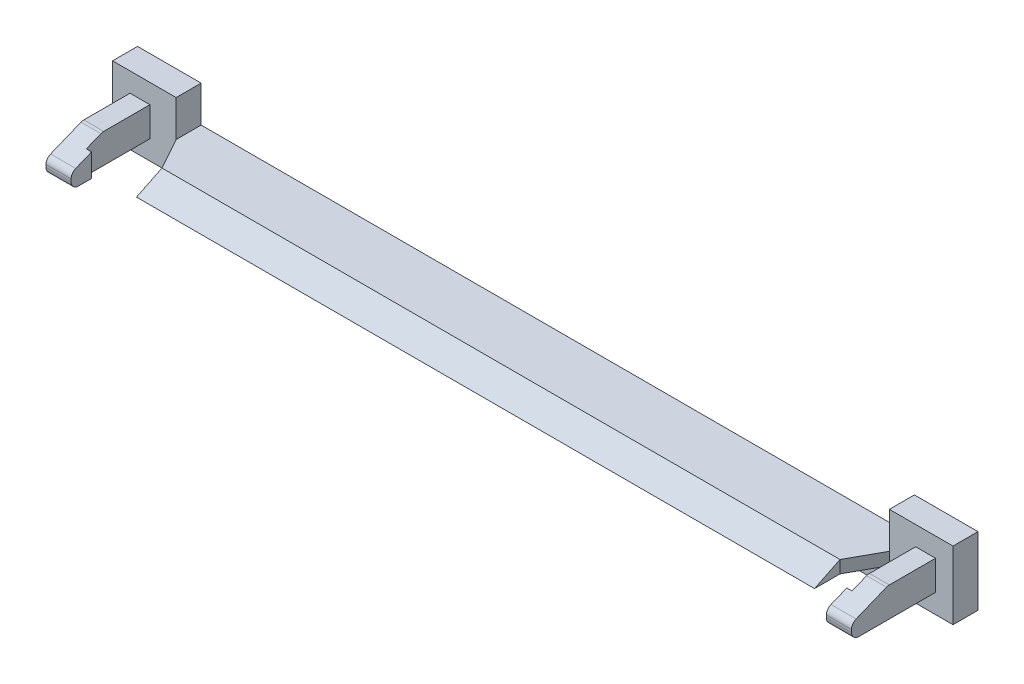
ISO-10303-21;
HEADER;
FILE_DESCRIPTION(('STEP AP214'),'2;1');
FILE_NAME('part.step','',(''),(''),'','','');
FILE_SCHEMA(('AUTOMOTIVE_DESIGN { 1 0 10303 214 1 1 1 1 }'));
ENDSEC;
DATA;
#1=APPLICATION_CONTEXT('core data for automotive mechanical design processes');
#2=APPLICATION_PROTOCOL_DEFINITION('international standard','automotive_design',2000,#1);
#3=PRODUCT_CONTEXT('',#1,'mechanical');
#4=PRODUCT('Part','Part','',(#3));
#5=PRODUCT_RELATED_PRODUCT_CATEGORY('part','',(#4));
#6=PRODUCT_DEFINITION_FORMATION('','',#4);
#7=PRODUCT_DEFINITION_CONTEXT('part definition',#1,'design');
#8=PRODUCT_DEFINITION('design','',#6,#7);
#9=PRODUCT_DEFINITION_SHAPE('','',#8);
#10=(LENGTH_UNIT() NAMED_UNIT(*) SI_UNIT(.MILLI.,.METRE.));
#11=(NAMED_UNIT(*) PLANE_ANGLE_UNIT() SI_UNIT($,.RADIAN.));
#12=(NAMED_UNIT(*) SI_UNIT($,.STERADIAN.) SOLID_ANGLE_UNIT());
#13=UNCERTAINTY_MEASURE_WITH_UNIT(LENGTH_MEASURE(1.E-05),#10,'distance_accuracy_value','');
#14=(GEOMETRIC_REPRESENTATION_CONTEXT(3) GLOBAL_UNCERTAINTY_ASSIGNED_CONTEXT((#13)) GLOBAL_UNIT_ASSIGNED_CONTEXT((#10,
#11,#12)) REPRESENTATION_CONTEXT('',''));
#15=CARTESIAN_POINT('',(0.,0.,0.));
#16=DIRECTION('',(0.,0.,1.));
#17=DIRECTION('',(1.,0.,0.));
#18=AXIS2_PLACEMENT_3D('',#15,#16,#17);
#19=CARTESIAN_POINT('',(16.625,-0.218763919545653,4.475));
#20=DIRECTION('',(1.,0.,0.));
#21=DIRECTION('',(0.,0.,-1.));
#22=AXIS2_PLACEMENT_3D('',#19,#20,#21);
#23=PLANE('',#22);
#24=CARTESIAN_POINT('',(16.625,-0.325000000000007,4.475));
#25=DIRECTION('',(-1.,0.,0.));
#26=DIRECTION('',(0.,-1.,0.));
#27=AXIS2_PLACEMENT_3D('',#24,#25,#26);
#28=CIRCLE('',#27,0.325);
#29=CARTESIAN_POINT('',(16.625,-0.325000000000007,4.8));
#30=VERTEX_POINT('',#29);
#31=CARTESIAN_POINT('',(16.625,-0.65,4.475));
#32=VERTEX_POINT('',#31);
#33=EDGE_CURVE('E247',#30,#32,#28,.F.);
#34=ORIENTED_EDGE('',*,*,#33,.F.);
#35=DIRECTION('',(0.,1.,0.));
#36=VECTOR('',#35,1.);
#37=CARTESIAN_POINT('',(16.625,-0.65,4.8));
#38=LINE('',#37,#36);
#39=CARTESIAN_POINT('',(16.625,-0.218763919545653,4.8));
#40=VERTEX_POINT('',#39);
#41=EDGE_CURVE('E237',#30,#40,#38,.T.);
#42=ORIENTED_EDGE('',*,*,#41,.T.);
#43=CARTESIAN_POINT('',(16.625,-0.218763919545653,4.475));
#44=DIRECTION('',(1.,0.,0.));
#45=DIRECTION('',(0.,0.,-1.));
#46=AXIS2_PLACEMENT_3D('',#43,#44,#45);
#47=CIRCLE('',#46,0.325);
#48=CARTESIAN_POINT('',(16.625,0.0823377180190975,4.59732254026068));
#49=VERTEX_POINT('',#48);
#50=EDGE_CURVE('E19',#49,#40,#47,.T.);
#51=ORIENTED_EDGE('',*,*,#50,.F.);
#52=DIRECTION('',(0.,-0.376377046955938,0.926466577122309));
#53=VECTOR('',#52,1.);
#54=CARTESIAN_POINT('',(16.625,0.,4.8));
#55=LINE('',#54,#53);
#56=CARTESIAN_POINT('',(16.625,0.365624999999999,3.9));
#57=VERTEX_POINT('',#56);
#58=EDGE_CURVE('E223',#57,#49,#55,.T.);
#59=ORIENTED_EDGE('',*,*,#58,.F.);
#60=DIRECTION('',(0.,1.,0.));
#61=VECTOR('',#60,1.);
#62=CARTESIAN_POINT('',(16.625,-0.65,3.9));
#63=LINE('',#62,#61);
#64=CARTESIAN_POINT('',(16.625,-0.65,3.9));
#65=VERTEX_POINT('',#64);
#66=EDGE_CURVE('E315',#65,#57,#63,.T.);
#67=ORIENTED_EDGE('',*,*,#66,.F.);
#68=DIRECTION('',(0.,0.,1.));
#69=VECTOR('',#68,1.);
#70=CARTESIAN_POINT('',(16.625,-0.65,4.8));
#71=LINE('',#70,#69);
#72=EDGE_CURVE('E300',#32,#65,#71,.F.);
#73=ORIENTED_EDGE('',*,*,#72,.F.);
#74=EDGE_LOOP('',(#34,#42,#51,#59,#67,#73));
#75=FACE_BOUND('',#74,.T.);
#76=ADVANCED_FACE('F16',(#75),#23,.F.);
#77=CARTESIAN_POINT('',(16.625,-0.65,3.9));
#78=DIRECTION('',(0.,0.,-1.));
#79=DIRECTION('',(-1.,0.,0.));
#80=AXIS2_PLACEMENT_3D('',#77,#78,#79);
#81=PLANE('',#80);
#82=ORIENTED_EDGE('',*,*,#66,.T.);
#83=DIRECTION('',(1.,0.,0.));
#84=VECTOR('',#83,1.);
#85=CARTESIAN_POINT('',(37.4304772879417,0.365624999999999,3.9));
#86=LINE('',#85,#84);
#87=CARTESIAN_POINT('',(16.855,0.365625,3.9));
#88=VERTEX_POINT('',#87);
#89=EDGE_CURVE('E254',#88,#57,#86,.F.);
#90=ORIENTED_EDGE('',*,*,#89,.F.);
#91=DIRECTION('',(0.,1.,0.));
#92=VECTOR('',#91,1.);
#93=CARTESIAN_POINT('',(16.855,-0.65,3.9));
#94=LINE('',#93,#92);
#95=CARTESIAN_POINT('',(16.855,-0.65,3.9));
#96=VERTEX_POINT('',#95);
#97=EDGE_CURVE('E318',#96,#88,#94,.T.);
#98=ORIENTED_EDGE('',*,*,#97,.F.);
#99=DIRECTION('',(1.,0.,0.));
#100=VECTOR('',#99,1.);
#101=CARTESIAN_POINT('',(17.73,-0.65,3.9));
#102=LINE('',#101,#100);
#103=EDGE_CURVE('E324',#65,#96,#102,.T.);
#104=ORIENTED_EDGE('',*,*,#103,.F.);
#105=EDGE_LOOP('',(#82,#90,#98,#104));
#106=FACE_BOUND('',#105,.T.);
#107=ADVANCED_FACE('F339',(#106),#81,.T.);
#108=CARTESIAN_POINT('',(37.4304772879417,0.,4.8));
#109=DIRECTION('',(0.,0.926466577122309,0.376377046955938));
#110=DIRECTION('',(0.,-0.376377046955938,0.926466577122309));
#111=AXIS2_PLACEMENT_3D('',#108,#109,#110);
#112=PLANE('',#111);
#113=DIRECTION('',(0.,-0.37637704695594,0.926466577122309));
#114=VECTOR('',#113,1.);
#115=CARTESIAN_POINT('',(17.73,0.626101637564757,3.25882673830214));
#116=LINE('',#115,#114);
#117=CARTESIAN_POINT('',(17.73,0.626101637564757,3.25882673830214));
#118=VERTEX_POINT('',#117);
#119=CARTESIAN_POINT('',(17.73,0.0823377180190975,4.59732254026068));
#120=VERTEX_POINT('',#119);
#121=EDGE_CURVE('E287',#118,#120,#116,.T.);
#122=ORIENTED_EDGE('',*,*,#121,.F.);
#123=DIRECTION('',(1.,0.,0.));
#124=VECTOR('',#123,1.);
#125=CARTESIAN_POINT('',(37.4304772879417,0.626101637564758,3.25882673830213));
#126=LINE('',#125,#124);
#127=CARTESIAN_POINT('',(16.855,0.626101637564757,3.25882673830214));
#128=VERTEX_POINT('',#127);
#129=EDGE_CURVE('E291',#128,#118,#126,.T.);
#130=ORIENTED_EDGE('',*,*,#129,.F.);
#131=DIRECTION('',(0.,0.37637704695594,-0.926466577122308));
#132=VECTOR('',#131,1.);
#133=CARTESIAN_POINT('',(16.855,0.365625,3.9));
#134=LINE('',#133,#132);
#135=EDGE_CURVE('E320',#88,#128,#134,.T.);
#136=ORIENTED_EDGE('',*,*,#135,.F.);
#137=ORIENTED_EDGE('',*,*,#89,.T.);
#138=ORIENTED_EDGE('',*,*,#58,.T.);
#139=DIRECTION('',(1.,0.,0.));
#140=VECTOR('',#139,1.);
#141=CARTESIAN_POINT('',(37.4304772879417,0.0823377180190974,4.59732254026068));
#142=LINE('',#141,#140);
#143=EDGE_CURVE('E234',#120,#49,#142,.F.);
#144=ORIENTED_EDGE('',*,*,#143,.F.);
#145=EDGE_LOOP('',(#122,#130,#136,#137,#138,#144));
#146=FACE_BOUND('',#145,.T.);
#147=ADVANCED_FACE('F447',(#146),#112,.T.);
#148=CARTESIAN_POINT('',(37.4304772879417,-0.218763919545653,4.475));
#149=DIRECTION('',(1.,0.,0.));
#150=DIRECTION('',(0.,0.,-1.));
#151=AXIS2_PLACEMENT_3D('',#148,#149,#150);
#152=CYLINDRICAL_SURFACE('',#151,0.325);
#153=DIRECTION('',(-1.,0.,0.));
#154=VECTOR('',#153,1.);
#155=CARTESIAN_POINT('',(17.73,-0.218763919545653,4.8));
#156=LINE('',#155,#154);
#157=CARTESIAN_POINT('',(17.73,-0.218763919545653,4.8));
#158=VERTEX_POINT('',#157);
#159=EDGE_CURVE('E232',#40,#158,#156,.F.);
#160=ORIENTED_EDGE('',*,*,#159,.T.);
#161=CARTESIAN_POINT('',(17.73,-0.218763919545653,4.475));
#162=DIRECTION('',(1.,0.,0.));
#163=DIRECTION('',(0.,0.,-1.));
#164=AXIS2_PLACEMENT_3D('',#161,#162,#163);
#165=CIRCLE('',#164,0.325);
#166=EDGE_CURVE('E285',#120,#158,#165,.T.);
#167=ORIENTED_EDGE('',*,*,#166,.F.);
#168=ORIENTED_EDGE('',*,*,#143,.T.);
#169=ORIENTED_EDGE('',*,*,#50,.T.);
#170=EDGE_LOOP('',(#160,#167,#168,#169));
#171=FACE_BOUND('',#170,.T.);
#172=ADVANCED_FACE('F230',(#171),#152,.T.);
#173=CARTESIAN_POINT('',(17.73,-0.65,4.8));
#174=DIRECTION('',(0.,0.,-1.));
#175=DIRECTION('',(-1.,0.,0.));
#176=AXIS2_PLACEMENT_3D('',#173,#174,#175);
#177=PLANE('',#176);
#178=ORIENTED_EDGE('',*,*,#159,.F.);
#179=ORIENTED_EDGE('',*,*,#41,.F.);
#180=DIRECTION('',(-1.,0.,0.));
#181=VECTOR('',#180,1.);
#182=CARTESIAN_POINT('',(17.73,-0.325000000000007,4.8));
#183=LINE('',#182,#181);
#184=CARTESIAN_POINT('',(17.73,-0.325000000000007,4.8));
#185=VERTEX_POINT('',#184);
#186=EDGE_CURVE('E243',#185,#30,#183,.T.);
#187=ORIENTED_EDGE('',*,*,#186,.F.);
#188=DIRECTION('',(0.,1.,0.));
#189=VECTOR('',#188,1.);
#190=CARTESIAN_POINT('',(17.73,0.65,4.8));
#191=LINE('',#190,#189);
#192=EDGE_CURVE('E242',#158,#185,#191,.F.);
#193=ORIENTED_EDGE('',*,*,#192,.F.);
#194=EDGE_LOOP('',(#178,#179,#187,#193));
#195=FACE_BOUND('',#194,.T.);
#196=ADVANCED_FACE('F239',(#195),#177,.F.);
#197=CARTESIAN_POINT('',(17.73,-0.325000000000007,4.475));
#198=DIRECTION('',(-1.,0.,0.));
#199=DIRECTION('',(0.,-1.,0.));
#200=AXIS2_PLACEMENT_3D('',#197,#198,#199);
#201=CYLINDRICAL_SURFACE('',#200,0.325);
#202=ORIENTED_EDGE('',*,*,#33,.T.);
#203=DIRECTION('',(1.,0.,0.));
#204=VECTOR('',#203,1.);
#205=CARTESIAN_POINT('',(17.73,-0.65,4.475));
#206=LINE('',#205,#204);
#207=CARTESIAN_POINT('',(17.73,-0.65,4.475));
#208=VERTEX_POINT('',#207);
#209=EDGE_CURVE('E296',#208,#32,#206,.F.);
#210=ORIENTED_EDGE('',*,*,#209,.F.);
#211=CARTESIAN_POINT('',(17.73,-0.325000000000007,4.475));
#212=DIRECTION('',(-1.,0.,0.));
#213=DIRECTION('',(0.,-1.,0.));
#214=AXIS2_PLACEMENT_3D('',#211,#212,#213);
#215=CIRCLE('',#214,0.325);
#216=EDGE_CURVE('E282',#185,#208,#215,.F.);
#217=ORIENTED_EDGE('',*,*,#216,.F.);
#218=ORIENTED_EDGE('',*,*,#186,.T.);
#219=EDGE_LOOP('',(#202,#210,#217,#218));
#220=FACE_BOUND('',#219,.T.);
#221=ADVANCED_FACE('F448',(#220),#201,.T.);
#222=CARTESIAN_POINT('',(17.73,-0.65,4.8));
#223=DIRECTION('',(0.,-1.,0.));
#224=DIRECTION('',(1.,0.,0.));
#225=AXIS2_PLACEMENT_3D('',#222,#223,#224);
#226=PLANE('',#225);
#227=DIRECTION('',(0.,0.,1.));
#228=VECTOR('',#227,1.);
#229=CARTESIAN_POINT('',(16.855,-0.65,4.8));
#230=LINE('',#229,#228);
#231=CARTESIAN_POINT('',(16.855,-0.65,1.1));
#232=VERTEX_POINT('',#231);
#233=EDGE_CURVE('E292',#232,#96,#230,.T.);
#234=ORIENTED_EDGE('',*,*,#233,.F.);
#235=DIRECTION('',(1.,0.,0.));
#236=VECTOR('',#235,1.);
#237=CARTESIAN_POINT('',(17.73,-0.65,1.1));
#238=LINE('',#237,#236);
#239=CARTESIAN_POINT('',(17.73,-0.65,1.1));
#240=VERTEX_POINT('',#239);
#241=EDGE_CURVE('E295',#232,#240,#238,.T.);
#242=ORIENTED_EDGE('',*,*,#241,.T.);
#243=DIRECTION('',(0.,0.,-1.));
#244=VECTOR('',#243,1.);
#245=CARTESIAN_POINT('',(17.73,-0.65,4.8));
#246=LINE('',#245,#244);
#247=EDGE_CURVE('E284',#208,#240,#246,.T.);
#248=ORIENTED_EDGE('',*,*,#247,.F.);
#249=ORIENTED_EDGE('',*,*,#209,.T.);
#250=ORIENTED_EDGE('',*,*,#72,.T.);
#251=ORIENTED_EDGE('',*,*,#103,.T.);
#252=EDGE_LOOP('',(#234,#242,#248,#249,#250,#251));
#253=FACE_BOUND('',#252,.T.);
#254=ADVANCED_FACE('F333',(#253),#226,.T.);
#255=CARTESIAN_POINT('',(-16.855,-0.65,4.8));
#256=DIRECTION('',(-1.,0.,0.));
#257=DIRECTION('',(0.,0.,1.));
#258=AXIS2_PLACEMENT_3D('',#255,#256,#257);
#259=PLANE('',#258);
#260=DIRECTION('',(0.,1.,0.));
#261=VECTOR('',#260,1.);
#262=CARTESIAN_POINT('',(-16.855,0.365625,3.9));
#263=LINE('',#262,#261);
#264=CARTESIAN_POINT('',(-16.855,-0.65,3.9));
#265=VERTEX_POINT('',#264);
#266=CARTESIAN_POINT('',(-16.855,0.365624999999999,3.9));
#267=VERTEX_POINT('',#266);
#268=EDGE_CURVE('E392',#265,#267,#263,.T.);
#269=ORIENTED_EDGE('',*,*,#268,.F.);
#270=DIRECTION('',(0.,0.,1.));
#271=VECTOR('',#270,1.);
#272=CARTESIAN_POINT('',(-16.855,-0.65,4.8));
#273=LINE('',#272,#271);
#274=CARTESIAN_POINT('',(-16.855,-0.65,1.1));
#275=VERTEX_POINT('',#274);
#276=EDGE_CURVE('E429',#265,#275,#273,.F.);
#277=ORIENTED_EDGE('',*,*,#276,.T.);
#278=DIRECTION('',(0.,1.,0.));
#279=VECTOR('',#278,1.);
#280=CARTESIAN_POINT('',(-16.855,-0.65,1.1));
#281=LINE('',#280,#279);
#282=CARTESIAN_POINT('',(-16.855,0.65,1.1));
#283=VERTEX_POINT('',#282);
#284=EDGE_CURVE('E294',#283,#275,#281,.F.);
#285=ORIENTED_EDGE('',*,*,#284,.F.);
#286=DIRECTION('',(0.,0.,1.));
#287=VECTOR('',#286,1.);
#288=CARTESIAN_POINT('',(-16.855,0.65,4.8));
#289=LINE('',#288,#287);
#290=CARTESIAN_POINT('',(-16.855,0.649999999999998,3.13650419804148));
#291=VERTEX_POINT('',#290);
#292=EDGE_CURVE('E405',#283,#291,#289,.T.);
#293=ORIENTED_EDGE('',*,*,#292,.T.);
#294=CARTESIAN_POINT('',(-16.855,0.324999999999996,3.13650419804148));
#295=DIRECTION('',(-1.,0.,0.));
#296=DIRECTION('',(0.,0.,1.));
#297=AXIS2_PLACEMENT_3D('',#294,#295,#296);
#298=CIRCLE('',#297,0.325);
#299=CARTESIAN_POINT('',(-16.855,0.626101637564747,3.25882673830216));
#300=VERTEX_POINT('',#299);
#301=EDGE_CURVE('E293',#300,#291,#298,.T.);
#302=ORIENTED_EDGE('',*,*,#301,.F.);
#303=DIRECTION('',(0.,0.376377046955938,-0.926466577122309));
#304=VECTOR('',#303,1.);
#305=CARTESIAN_POINT('',(-16.855,0.365625,3.9));
#306=LINE('',#305,#304);
#307=EDGE_CURVE('E402',#267,#300,#306,.T.);
#308=ORIENTED_EDGE('',*,*,#307,.F.);
#309=EDGE_LOOP('',(#269,#277,#285,#293,#302,#308));
#310=FACE_BOUND('',#309,.T.);
#311=ADVANCED_FACE('F456',(#310),#259,.F.);
#312=CARTESIAN_POINT('',(-16.625,0.365625,3.9));
#313=DIRECTION('',(0.,0.,-1.));
#314=DIRECTION('',(-1.,0.,0.));
#315=AXIS2_PLACEMENT_3D('',#312,#313,#314);
#316=PLANE('',#315);
#317=DIRECTION('',(0.,1.,0.));
#318=VECTOR('',#317,1.);
#319=CARTESIAN_POINT('',(-16.625,-0.325,3.9));
#320=LINE('',#319,#318);
#321=CARTESIAN_POINT('',(-16.625,0.365624999999999,3.9));
#322=VERTEX_POINT('',#321);
#323=CARTESIAN_POINT('',(-16.625,-0.65,3.9));
#324=VERTEX_POINT('',#323);
#325=EDGE_CURVE('E321',#322,#324,#320,.F.);
#326=ORIENTED_EDGE('',*,*,#325,.T.);
#327=DIRECTION('',(1.,0.,0.));
#328=VECTOR('',#327,1.);
#329=CARTESIAN_POINT('',(-17.73,-0.65,3.9));
#330=LINE('',#329,#328);
#331=EDGE_CURVE('E423',#324,#265,#330,.F.);
#332=ORIENTED_EDGE('',*,*,#331,.T.);
#333=ORIENTED_EDGE('',*,*,#268,.T.);
#334=DIRECTION('',(1.,0.,0.));
#335=VECTOR('',#334,1.);
#336=CARTESIAN_POINT('',(-37.4304772879417,0.365624999999999,3.9));
#337=LINE('',#336,#335);
#338=EDGE_CURVE('E388',#267,#322,#337,.T.);
#339=ORIENTED_EDGE('',*,*,#338,.T.);
#340=EDGE_LOOP('',(#326,#332,#333,#339));
#341=FACE_BOUND('',#340,.T.);
#342=ADVANCED_FACE('F569',(#341),#316,.T.);
#343=CARTESIAN_POINT('',(-16.625,-0.325,4.475));
#344=DIRECTION('',(-1.,0.,0.));
#345=DIRECTION('',(0.,0.,1.));
#346=AXIS2_PLACEMENT_3D('',#343,#344,#345);
#347=PLANE('',#346);
#348=DIRECTION('',(0.,0.376377046955938,-0.926466577122309));
#349=VECTOR('',#348,1.);
#350=CARTESIAN_POINT('',(-16.625,0.,4.8));
#351=LINE('',#350,#349);
#352=CARTESIAN_POINT('',(-16.625,0.0823377180190975,4.59732254026068));
#353=VERTEX_POINT('',#352);
#354=EDGE_CURVE('E274',#322,#353,#351,.F.);
#355=ORIENTED_EDGE('',*,*,#354,.T.);
#356=CARTESIAN_POINT('',(-16.625,-0.218763919545653,4.475));
#357=DIRECTION('',(1.,0.,0.));
#358=DIRECTION('',(0.,0.,-1.));
#359=AXIS2_PLACEMENT_3D('',#356,#357,#358);
#360=CIRCLE('',#359,0.325);
#361=CARTESIAN_POINT('',(-16.625,-0.218763919545653,4.8));
#362=VERTEX_POINT('',#361);
#363=EDGE_CURVE('E271',#362,#353,#360,.F.);
#364=ORIENTED_EDGE('',*,*,#363,.F.);
#365=DIRECTION('',(0.,1.,0.));
#366=VECTOR('',#365,1.);
#367=CARTESIAN_POINT('',(-16.625,-0.65,4.8));
#368=LINE('',#367,#366);
#369=CARTESIAN_POINT('',(-16.625,-0.325000000000004,4.8));
#370=VERTEX_POINT('',#369);
#371=EDGE_CURVE('E383',#370,#362,#368,.T.);
#372=ORIENTED_EDGE('',*,*,#371,.F.);
#373=CARTESIAN_POINT('',(-16.625,-0.325000000000004,4.475));
#374=DIRECTION('',(1.,0.,0.));
#375=DIRECTION('',(0.,0.,-1.));
#376=AXIS2_PLACEMENT_3D('',#373,#374,#375);
#377=CIRCLE('',#376,0.325);
#378=CARTESIAN_POINT('',(-16.625,-0.65,4.475));
#379=VERTEX_POINT('',#378);
#380=EDGE_CURVE('E275',#379,#370,#377,.F.);
#381=ORIENTED_EDGE('',*,*,#380,.F.);
#382=DIRECTION('',(0.,0.,1.));
#383=VECTOR('',#382,1.);
#384=CARTESIAN_POINT('',(-16.625,-0.65,4.8));
#385=LINE('',#384,#383);
#386=EDGE_CURVE('E420',#379,#324,#385,.F.);
#387=ORIENTED_EDGE('',*,*,#386,.T.);
#388=ORIENTED_EDGE('',*,*,#325,.F.);
#389=EDGE_LOOP('',(#355,#364,#372,#381,#387,#388));
#390=FACE_BOUND('',#389,.T.);
#391=ADVANCED_FACE('F566',(#390),#347,.F.);
#392=CARTESIAN_POINT('',(16.855,-0.65,4.8));
#393=DIRECTION('',(-1.,0.,0.));
#394=DIRECTION('',(0.,0.,1.));
#395=AXIS2_PLACEMENT_3D('',#392,#393,#394);
#396=PLANE('',#395);
#397=DIRECTION('',(0.,1.,0.));
#398=VECTOR('',#397,1.);
#399=CARTESIAN_POINT('',(16.855,-0.65,1.1));
#400=LINE('',#399,#398);
#401=CARTESIAN_POINT('',(16.855,0.65,1.1));
#402=VERTEX_POINT('',#401);
#403=EDGE_CURVE('E311',#402,#232,#400,.F.);
#404=ORIENTED_EDGE('',*,*,#403,.T.);
#405=ORIENTED_EDGE('',*,*,#233,.T.);
#406=ORIENTED_EDGE('',*,*,#97,.T.);
#407=ORIENTED_EDGE('',*,*,#135,.T.);
#408=CARTESIAN_POINT('',(16.855,0.325000000000006,3.13650419804146));
#409=DIRECTION('',(1.,0.,0.));
#410=DIRECTION('',(0.,0.,-1.));
#411=AXIS2_PLACEMENT_3D('',#408,#409,#410);
#412=CIRCLE('',#411,0.325);
#413=CARTESIAN_POINT('',(16.855,0.65,3.13650419804146));
#414=VERTEX_POINT('',#413);
#415=EDGE_CURVE('E288',#414,#128,#412,.T.);
#416=ORIENTED_EDGE('',*,*,#415,.F.);
#417=DIRECTION('',(0.,0.,1.));
#418=VECTOR('',#417,1.);
#419=CARTESIAN_POINT('',(16.855,0.65,4.8));
#420=LINE('',#419,#418);
#421=EDGE_CURVE('E371',#402,#414,#420,.T.);
#422=ORIENTED_EDGE('',*,*,#421,.F.);
#423=EDGE_LOOP('',(#404,#405,#406,#407,#416,#422));
#424=FACE_BOUND('',#423,.T.);
#425=ADVANCED_FACE('F342',(#424),#396,.T.);
#426=CARTESIAN_POINT('',(37.4304772879417,0.325000000000009,3.13650419804145));
#427=DIRECTION('',(1.,0.,0.));
#428=DIRECTION('',(0.,0.,-1.));
#429=AXIS2_PLACEMENT_3D('',#426,#427,#428);
#430=CYLINDRICAL_SURFACE('',#429,0.325);
#431=ORIENTED_EDGE('',*,*,#415,.T.);
#432=ORIENTED_EDGE('',*,*,#129,.T.);
#433=CARTESIAN_POINT('',(17.73,0.325000000000007,3.13650419804146));
#434=DIRECTION('',(1.,0.,0.));
#435=DIRECTION('',(0.,0.,-1.));
#436=AXIS2_PLACEMENT_3D('',#433,#434,#435);
#437=CIRCLE('',#436,0.325);
#438=CARTESIAN_POINT('',(17.73,0.65,3.13650419804146));
#439=VERTEX_POINT('',#438);
#440=EDGE_CURVE('E278',#439,#118,#437,.T.);
#441=ORIENTED_EDGE('',*,*,#440,.F.);
#442=DIRECTION('',(-1.,0.,0.));
#443=VECTOR('',#442,1.);
#444=CARTESIAN_POINT('',(16.855,0.65,3.13650419804146));
#445=LINE('',#444,#443);
#446=EDGE_CURVE('E373',#414,#439,#445,.F.);
#447=ORIENTED_EDGE('',*,*,#446,.F.);
#448=EDGE_LOOP('',(#431,#432,#441,#447));
#449=FACE_BOUND('',#448,.T.);
#450=ADVANCED_FACE('F561',(#449),#430,.T.);
#451=CARTESIAN_POINT('',(17.73,0.65,4.8));
#452=DIRECTION('',(1.,0.,0.));
#453=DIRECTION('',(0.,0.,-1.));
#454=AXIS2_PLACEMENT_3D('',#451,#452,#453);
#455=PLANE('',#454);
#456=DIRECTION('',(0.,0.,1.));
#457=VECTOR('',#456,1.);
#458=CARTESIAN_POINT('',(17.73,0.65,4.8));
#459=LINE('',#458,#457);
#460=CARTESIAN_POINT('',(17.73,0.65,1.1));
#461=VERTEX_POINT('',#460);
#462=EDGE_CURVE('E270',#439,#461,#459,.F.);
#463=ORIENTED_EDGE('',*,*,#462,.F.);
#464=ORIENTED_EDGE('',*,*,#440,.T.);
#465=ORIENTED_EDGE('',*,*,#121,.T.);
#466=ORIENTED_EDGE('',*,*,#166,.T.);
#467=ORIENTED_EDGE('',*,*,#192,.T.);
#468=ORIENTED_EDGE('',*,*,#216,.T.);
#469=ORIENTED_EDGE('',*,*,#247,.T.);
#470=DIRECTION('',(0.,1.,0.));
#471=VECTOR('',#470,1.);
#472=CARTESIAN_POINT('',(17.73,0.65,1.1));
#473=LINE('',#472,#471);
#474=EDGE_CURVE('E281',#240,#461,#473,.T.);
#475=ORIENTED_EDGE('',*,*,#474,.T.);
#476=EDGE_LOOP('',(#463,#464,#465,#466,#467,#468,#469,#475));
#477=FACE_BOUND('',#476,.T.);
#478=ADVANCED_FACE('F351',(#477),#455,.T.);
#479=CARTESIAN_POINT('',(-17.73,-0.325000000000004,4.475));
#480=DIRECTION('',(1.,0.,0.));
#481=DIRECTION('',(0.,0.,-1.));
#482=AXIS2_PLACEMENT_3D('',#479,#480,#481);
#483=CYLINDRICAL_SURFACE('',#482,0.325);
#484=ORIENTED_EDGE('',*,*,#380,.T.);
#485=DIRECTION('',(1.,0.,0.));
#486=VECTOR('',#485,1.);
#487=CARTESIAN_POINT('',(-17.73,-0.325000000000004,4.8));
#488=LINE('',#487,#486);
#489=CARTESIAN_POINT('',(-17.73,-0.325000000000004,4.8));
#490=VERTEX_POINT('',#489);
#491=EDGE_CURVE('E385',#490,#370,#488,.T.);
#492=ORIENTED_EDGE('',*,*,#491,.F.);
#493=CARTESIAN_POINT('',(-17.73,-0.325000000000004,4.475));
#494=DIRECTION('',(1.,0.,0.));
#495=DIRECTION('',(0.,0.,-1.));
#496=AXIS2_PLACEMENT_3D('',#493,#494,#495);
#497=CIRCLE('',#496,0.325);
#498=CARTESIAN_POINT('',(-17.73,-0.65,4.475));
#499=VERTEX_POINT('',#498);
#500=EDGE_CURVE('E266',#490,#499,#497,.T.);
#501=ORIENTED_EDGE('',*,*,#500,.T.);
#502=DIRECTION('',(1.,0.,0.));
#503=VECTOR('',#502,1.);
#504=CARTESIAN_POINT('',(-17.73,-0.65,4.475));
#505=LINE('',#504,#503);
#506=EDGE_CURVE('E424',#499,#379,#505,.T.);
#507=ORIENTED_EDGE('',*,*,#506,.T.);
#508=EDGE_LOOP('',(#484,#492,#501,#507));
#509=FACE_BOUND('',#508,.T.);
#510=ADVANCED_FACE('F554',(#509),#483,.T.);
#511=CARTESIAN_POINT('',(-17.73,-0.65,4.8));
#512=DIRECTION('',(0.,1.,0.));
#513=DIRECTION('',(0.,0.,1.));
#514=AXIS2_PLACEMENT_3D('',#511,#512,#513);
#515=PLANE('',#514);
#516=ORIENTED_EDGE('',*,*,#331,.F.);
#517=ORIENTED_EDGE('',*,*,#386,.F.);
#518=ORIENTED_EDGE('',*,*,#506,.F.);
#519=DIRECTION('',(0.,0.,-1.));
#520=VECTOR('',#519,1.);
#521=CARTESIAN_POINT('',(-17.73,-0.65,4.8));
#522=LINE('',#521,#520);
#523=CARTESIAN_POINT('',(-17.73,-0.65,1.1));
#524=VERTEX_POINT('',#523);
#525=EDGE_CURVE('E269',#499,#524,#522,.T.);
#526=ORIENTED_EDGE('',*,*,#525,.T.);
#527=DIRECTION('',(1.,0.,0.));
#528=VECTOR('',#527,1.);
#529=CARTESIAN_POINT('',(-17.73,-0.65,1.1));
#530=LINE('',#529,#528);
#531=EDGE_CURVE('E277',#275,#524,#530,.F.);
#532=ORIENTED_EDGE('',*,*,#531,.F.);
#533=ORIENTED_EDGE('',*,*,#276,.F.);
#534=EDGE_LOOP('',(#516,#517,#518,#526,#532,#533));
#535=FACE_BOUND('',#534,.T.);
#536=ADVANCED_FACE('F550',(#535),#515,.F.);
#537=CARTESIAN_POINT('',(-16.855,0.65,4.8));
#538=DIRECTION('',(0.,-1.,0.));
#539=DIRECTION('',(1.,0.,0.));
#540=AXIS2_PLACEMENT_3D('',#537,#538,#539);
#541=PLANE('',#540);
#542=DIRECTION('',(-1.,0.,0.));
#543=VECTOR('',#542,1.);
#544=CARTESIAN_POINT('',(-16.855,0.649999999999996,3.13650419804148));
#545=LINE('',#544,#543);
#546=CARTESIAN_POINT('',(-17.73,0.649999999999998,3.13650419804148));
#547=VERTEX_POINT('',#546);
#548=EDGE_CURVE('E408',#291,#547,#545,.T.);
#549=ORIENTED_EDGE('',*,*,#548,.F.);
#550=ORIENTED_EDGE('',*,*,#292,.F.);
#551=DIRECTION('',(1.,0.,0.));
#552=VECTOR('',#551,1.);
#553=CARTESIAN_POINT('',(-16.855,0.65,1.1));
#554=LINE('',#553,#552);
#555=CARTESIAN_POINT('',(-17.73,0.65,1.1));
#556=VERTEX_POINT('',#555);
#557=EDGE_CURVE('E409',#556,#283,#554,.T.);
#558=ORIENTED_EDGE('',*,*,#557,.F.);
#559=DIRECTION('',(0.,0.,-1.));
#560=VECTOR('',#559,1.);
#561=CARTESIAN_POINT('',(-17.73,0.65,4.8));
#562=LINE('',#561,#560);
#563=EDGE_CURVE('E265',#556,#547,#562,.F.);
#564=ORIENTED_EDGE('',*,*,#563,.T.);
#565=EDGE_LOOP('',(#549,#550,#558,#564));
#566=FACE_BOUND('',#565,.T.);
#567=ADVANCED_FACE('F546',(#566),#541,.F.);
#568=CARTESIAN_POINT('',(-16.855,0.324999999999996,3.13650419804148));
#569=DIRECTION('',(-1.,0.,0.));
#570=DIRECTION('',(0.,0.,1.));
#571=AXIS2_PLACEMENT_3D('',#568,#569,#570);
#572=CYLINDRICAL_SURFACE('',#571,0.325);
#573=ORIENTED_EDGE('',*,*,#301,.T.);
#574=ORIENTED_EDGE('',*,*,#548,.T.);
#575=CARTESIAN_POINT('',(-17.73,0.324999999999996,3.13650419804148));
#576=DIRECTION('',(-1.,0.,0.));
#577=DIRECTION('',(0.,0.,1.));
#578=AXIS2_PLACEMENT_3D('',#575,#576,#577);
#579=CIRCLE('',#578,0.325);
#580=CARTESIAN_POINT('',(-17.73,0.626101637564746,3.25882673830216));
#581=VERTEX_POINT('',#580);
#582=EDGE_CURVE('E262',#547,#581,#579,.F.);
#583=ORIENTED_EDGE('',*,*,#582,.T.);
#584=DIRECTION('',(1.,0.,0.));
#585=VECTOR('',#584,1.);
#586=CARTESIAN_POINT('',(-37.4304772879417,0.626101637564746,3.25882673830216));
#587=LINE('',#586,#585);
#588=EDGE_CURVE('E397',#581,#300,#587,.T.);
#589=ORIENTED_EDGE('',*,*,#588,.T.);
#590=EDGE_LOOP('',(#573,#574,#583,#589));
#591=FACE_BOUND('',#590,.T.);
#592=ADVANCED_FACE('F542',(#591),#572,.T.);
#593=CARTESIAN_POINT('',(-37.4304772879417,0.,4.8));
#594=DIRECTION('',(0.,-0.926466577122309,-0.376377046955938));
#595=DIRECTION('',(0.,0.376377046955938,-0.926466577122309));
#596=AXIS2_PLACEMENT_3D('',#593,#594,#595);
#597=PLANE('',#596);
#598=DIRECTION('',(1.,0.,0.));
#599=VECTOR('',#598,1.);
#600=CARTESIAN_POINT('',(-37.4304772879417,0.0823377180190974,4.59732254026068));
#601=LINE('',#600,#599);
#602=CARTESIAN_POINT('',(-17.73,0.0823377180190975,4.59732254026068));
#603=VERTEX_POINT('',#602);
#604=EDGE_CURVE('E273',#353,#603,#601,.F.);
#605=ORIENTED_EDGE('',*,*,#604,.F.);
#606=ORIENTED_EDGE('',*,*,#354,.F.);
#607=ORIENTED_EDGE('',*,*,#338,.F.);
#608=ORIENTED_EDGE('',*,*,#307,.T.);
#609=ORIENTED_EDGE('',*,*,#588,.F.);
#610=DIRECTION('',(0.,-0.376377046955939,0.926466577122309));
#611=VECTOR('',#610,1.);
#612=CARTESIAN_POINT('',(-17.73,0.626101637564747,3.25882673830216));
#613=LINE('',#612,#611);
#614=EDGE_CURVE('E261',#581,#603,#613,.T.);
#615=ORIENTED_EDGE('',*,*,#614,.T.);
#616=EDGE_LOOP('',(#605,#606,#607,#608,#609,#615));
#617=FACE_BOUND('',#616,.T.);
#618=ADVANCED_FACE('F538',(#617),#597,.F.);
#619=CARTESIAN_POINT('',(-37.4304772879417,-0.218763919545653,4.475));
#620=DIRECTION('',(1.,0.,0.));
#621=DIRECTION('',(0.,0.,-1.));
#622=AXIS2_PLACEMENT_3D('',#619,#620,#621);
#623=CYLINDRICAL_SURFACE('',#622,0.325);
#624=ORIENTED_EDGE('',*,*,#363,.T.);
#625=ORIENTED_EDGE('',*,*,#604,.T.);
#626=CARTESIAN_POINT('',(-17.73,-0.218763919545653,4.475));
#627=DIRECTION('',(1.,0.,0.));
#628=DIRECTION('',(0.,0.,-1.));
#629=AXIS2_PLACEMENT_3D('',#626,#627,#628);
#630=CIRCLE('',#629,0.325);
#631=CARTESIAN_POINT('',(-17.73,-0.218763919545653,4.8));
#632=VERTEX_POINT('',#631);
#633=EDGE_CURVE('E257',#603,#632,#630,.T.);
#634=ORIENTED_EDGE('',*,*,#633,.T.);
#635=DIRECTION('',(1.,0.,0.));
#636=VECTOR('',#635,1.);
#637=CARTESIAN_POINT('',(-17.73,-0.218763919545653,4.8));
#638=LINE('',#637,#636);
#639=EDGE_CURVE('E374',#362,#632,#638,.F.);
#640=ORIENTED_EDGE('',*,*,#639,.F.);
#641=EDGE_LOOP('',(#624,#625,#634,#640));
#642=FACE_BOUND('',#641,.T.);
#643=ADVANCED_FACE('F534',(#642),#623,.T.);
#644=CARTESIAN_POINT('',(-17.73,-0.65,4.8));
#645=DIRECTION('',(0.,0.,1.));
#646=DIRECTION('',(1.,0.,0.));
#647=AXIS2_PLACEMENT_3D('',#644,#645,#646);
#648=PLANE('',#647);
#649=ORIENTED_EDGE('',*,*,#639,.T.);
#650=DIRECTION('',(0.,1.,0.));
#651=VECTOR('',#650,1.);
#652=CARTESIAN_POINT('',(-17.73,0.65,4.8));
#653=LINE('',#652,#651);
#654=EDGE_CURVE('E260',#632,#490,#653,.F.);
#655=ORIENTED_EDGE('',*,*,#654,.T.);
#656=ORIENTED_EDGE('',*,*,#491,.T.);
#657=ORIENTED_EDGE('',*,*,#371,.T.);
#658=EDGE_LOOP('',(#649,#655,#656,#657));
#659=FACE_BOUND('',#658,.T.);
#660=ADVANCED_FACE('F531',(#659),#648,.T.);
#661=CARTESIAN_POINT('',(16.855,0.65,4.8));
#662=DIRECTION('',(0.,1.,0.));
#663=DIRECTION('',(-1.,0.,0.));
#664=AXIS2_PLACEMENT_3D('',#661,#662,#663);
#665=PLANE('',#664);
#666=ORIENTED_EDGE('',*,*,#462,.T.);
#667=DIRECTION('',(-1.,0.,0.));
#668=VECTOR('',#667,1.);
#669=CARTESIAN_POINT('',(18.5,0.65,1.1));
#670=LINE('',#669,#668);
#671=EDGE_CURVE('E358',#461,#402,#670,.T.);
#672=ORIENTED_EDGE('',*,*,#671,.T.);
#673=ORIENTED_EDGE('',*,*,#421,.T.);
#674=ORIENTED_EDGE('',*,*,#446,.T.);
#675=EDGE_LOOP('',(#666,#672,#673,#674));
#676=FACE_BOUND('',#675,.T.);
#677=ADVANCED_FACE('F445',(#676),#665,.T.);
#678=CARTESIAN_POINT('',(-17.73,0.65,4.8));
#679=DIRECTION('',(1.,0.,0.));
#680=DIRECTION('',(0.,0.,-1.));
#681=AXIS2_PLACEMENT_3D('',#678,#679,#680);
#682=PLANE('',#681);
#683=ORIENTED_EDGE('',*,*,#633,.F.);
#684=ORIENTED_EDGE('',*,*,#614,.F.);
#685=ORIENTED_EDGE('',*,*,#582,.F.);
#686=ORIENTED_EDGE('',*,*,#563,.F.);
#687=DIRECTION('',(0.,1.,0.));
#688=VECTOR('',#687,1.);
#689=CARTESIAN_POINT('',(-17.73,-1.5,1.1));
#690=LINE('',#689,#688);
#691=EDGE_CURVE('E367',#556,#524,#690,.F.);
#692=ORIENTED_EDGE('',*,*,#691,.T.);
#693=ORIENTED_EDGE('',*,*,#525,.F.);
#694=ORIENTED_EDGE('',*,*,#500,.F.);
#695=ORIENTED_EDGE('',*,*,#654,.F.);
#696=EDGE_LOOP('',(#683,#684,#685,#686,#692,#693,#694,#695));
#697=FACE_BOUND('',#696,.T.);
#698=ADVANCED_FACE('F524',(#697),#682,.F.);
#699=CARTESIAN_POINT('',(18.5,-1.5,1.1));
#700=DIRECTION('',(0.,0.,-1.));
#701=DIRECTION('',(-1.,0.,0.));
#702=AXIS2_PLACEMENT_3D('',#699,#700,#701);
#703=PLANE('',#702);
#704=ORIENTED_EDGE('',*,*,#557,.T.);
#705=ORIENTED_EDGE('',*,*,#284,.T.);
#706=ORIENTED_EDGE('',*,*,#531,.T.);
#707=ORIENTED_EDGE('',*,*,#691,.F.);
#708=EDGE_LOOP('',(#704,#705,#706,#707));
#709=FACE_BOUND('',#708,.T.);
#710=ORIENTED_EDGE('',*,*,#474,.F.);
#711=ORIENTED_EDGE('',*,*,#241,.F.);
#712=ORIENTED_EDGE('',*,*,#403,.F.);
#713=ORIENTED_EDGE('',*,*,#671,.F.);
#714=EDGE_LOOP('',(#710,#711,#712,#713));
#715=FACE_BOUND('',#714,.T.);
#716=DIRECTION('',(1.,0.,0.));
#717=VECTOR('',#716,1.);
#718=CARTESIAN_POINT('',(18.5,-1.5,1.1));
#719=LINE('',#718,#717);
#720=CARTESIAN_POINT('',(18.5,-1.5,1.1));
#721=VERTEX_POINT('',#720);
#722=CARTESIAN_POINT('',(-18.5,-1.5,1.1));
#723=VERTEX_POINT('',#722);
#724=EDGE_CURVE('E645',#721,#723,#719,.F.);
#725=ORIENTED_EDGE('',*,*,#724,.F.);
#726=DIRECTION('',(0.,1.,0.));
#727=VECTOR('',#726,1.);
#728=CARTESIAN_POINT('',(18.5,1.5,1.1));
#729=LINE('',#728,#727);
#730=CARTESIAN_POINT('',(18.5,1.5,1.1));
#731=VERTEX_POINT('',#730);
#732=EDGE_CURVE('E603',#731,#721,#729,.F.);
#733=ORIENTED_EDGE('',*,*,#732,.F.);
#734=DIRECTION('',(-1.,0.,0.));
#735=VECTOR('',#734,1.);
#736=CARTESIAN_POINT('',(15.7,1.5,1.1));
#737=LINE('',#736,#735);
#738=CARTESIAN_POINT('',(15.7,1.5,1.1));
#739=VERTEX_POINT('',#738);
#740=EDGE_CURVE('E664',#739,#731,#737,.F.);
#741=ORIENTED_EDGE('',*,*,#740,.F.);
#742=DIRECTION('',(0.,1.,0.));
#743=VECTOR('',#742,1.);
#744=CARTESIAN_POINT('',(15.7,-1.5,1.1));
#745=LINE('',#744,#743);
#746=CARTESIAN_POINT('',(15.7,-0.100000000000002,1.1));
#747=VERTEX_POINT('',#746);
#748=EDGE_CURVE('E368',#747,#739,#745,.T.);
#749=ORIENTED_EDGE('',*,*,#748,.F.);
#750=DIRECTION('',(0.,1.,0.));
#751=VECTOR('',#750,1.);
#752=CARTESIAN_POINT('',(15.7,-1.5,1.1));
#753=LINE('',#752,#751);
#754=CARTESIAN_POINT('',(15.7,-0.649999999999997,1.1));
#755=VERTEX_POINT('',#754);
#756=EDGE_CURVE('E636',#755,#747,#753,.T.);
#757=ORIENTED_EDGE('',*,*,#756,.F.);
#758=DIRECTION('',(-1.,0.,0.));
#759=VECTOR('',#758,1.);
#760=CARTESIAN_POINT('',(-15.7,-0.65,1.1));
#761=LINE('',#760,#759);
#762=CARTESIAN_POINT('',(-15.7,-0.650000000000003,1.1));
#763=VERTEX_POINT('',#762);
#764=EDGE_CURVE('E668',#755,#763,#761,.T.);
#765=ORIENTED_EDGE('',*,*,#764,.T.);
#766=DIRECTION('',(0.,1.,0.));
#767=VECTOR('',#766,1.);
#768=CARTESIAN_POINT('',(-15.7,-1.5,1.1));
#769=LINE('',#768,#767);
#770=CARTESIAN_POINT('',(-15.7,-0.100000000000023,1.1));
#771=VERTEX_POINT('',#770);
#772=EDGE_CURVE('E632',#771,#763,#769,.F.);
#773=ORIENTED_EDGE('',*,*,#772,.F.);
#774=DIRECTION('',(0.,1.,0.));
#775=VECTOR('',#774,1.);
#776=CARTESIAN_POINT('',(-15.7,-1.5,1.1));
#777=LINE('',#776,#775);
#778=CARTESIAN_POINT('',(-15.7,1.5,1.1));
#779=VERTEX_POINT('',#778);
#780=EDGE_CURVE('E630',#779,#771,#777,.F.);
#781=ORIENTED_EDGE('',*,*,#780,.F.);
#782=DIRECTION('',(1.,0.,0.));
#783=VECTOR('',#782,1.);
#784=CARTESIAN_POINT('',(-15.7,1.5,1.1));
#785=LINE('',#784,#783);
#786=CARTESIAN_POINT('',(-18.5,1.5,1.1));
#787=VERTEX_POINT('',#786);
#788=EDGE_CURVE('E656',#779,#787,#785,.F.);
#789=ORIENTED_EDGE('',*,*,#788,.T.);
#790=DIRECTION('',(0.,1.,0.));
#791=VECTOR('',#790,1.);
#792=CARTESIAN_POINT('',(-18.5,1.5,1.1));
#793=LINE('',#792,#791);
#794=EDGE_CURVE('E647',#787,#723,#793,.F.);
#795=ORIENTED_EDGE('',*,*,#794,.T.);
#796=EDGE_LOOP('',(#725,#733,#741,#749,#757,#765,#773,#781,#789,#795));
#797=FACE_BOUND('',#796,.T.);
#798=ADVANCED_FACE('F355',(#709,#715,#797),#703,.F.);
#799=CARTESIAN_POINT('',(18.5,1.5,1.1));
#800=DIRECTION('',(1.,0.,0.));
#801=DIRECTION('',(0.,0.,-1.));
#802=AXIS2_PLACEMENT_3D('',#799,#800,#801);
#803=PLANE('',#802);
#804=ORIENTED_EDGE('',*,*,#732,.T.);
#805=DIRECTION('',(0.,0.,1.));
#806=VECTOR('',#805,1.);
#807=CARTESIAN_POINT('',(18.5,-1.5,1.1));
#808=LINE('',#807,#806);
#809=CARTESIAN_POINT('',(18.5,-1.5,0.));
#810=VERTEX_POINT('',#809);
#811=EDGE_CURVE('E642',#810,#721,#808,.T.);
#812=ORIENTED_EDGE('',*,*,#811,.F.);
#813=DIRECTION('',(0.,1.,0.));
#814=VECTOR('',#813,1.);
#815=CARTESIAN_POINT('',(18.5,-1.5,0.));
#816=LINE('',#815,#814);
#817=CARTESIAN_POINT('',(18.5,1.5,0.));
#818=VERTEX_POINT('',#817);
#819=EDGE_CURVE('E678',#818,#810,#816,.F.);
#820=ORIENTED_EDGE('',*,*,#819,.F.);
#821=DIRECTION('',(0.,0.,1.));
#822=VECTOR('',#821,1.);
#823=CARTESIAN_POINT('',(18.5,1.5,1.1));
#824=LINE('',#823,#822);
#825=EDGE_CURVE('E666',#731,#818,#824,.F.);
#826=ORIENTED_EDGE('',*,*,#825,.F.);
#827=EDGE_LOOP('',(#804,#812,#820,#826));
#828=FACE_BOUND('',#827,.T.);
#829=ADVANCED_FACE('F517',(#828),#803,.T.);
#830=CARTESIAN_POINT('',(18.5,-1.5,1.1));
#831=DIRECTION('',(0.,-1.,0.));
#832=DIRECTION('',(1.,0.,0.));
#833=AXIS2_PLACEMENT_3D('',#830,#831,#832);
#834=PLANE('',#833);
#835=ORIENTED_EDGE('',*,*,#724,.T.);
#836=DIRECTION('',(0.,0.,-1.));
#837=VECTOR('',#836,1.);
#838=CARTESIAN_POINT('',(-18.5,-1.5,1.1));
#839=LINE('',#838,#837);
#840=CARTESIAN_POINT('',(-18.5,-1.5,0.));
#841=VERTEX_POINT('',#840);
#842=EDGE_CURVE('E650',#723,#841,#839,.T.);
#843=ORIENTED_EDGE('',*,*,#842,.T.);
#844=DIRECTION('',(-1.,0.,0.));
#845=VECTOR('',#844,1.);
#846=CARTESIAN_POINT('',(18.5,-1.5,0.));
#847=LINE('',#846,#845);
#848=EDGE_CURVE('E680',#810,#841,#847,.T.);
#849=ORIENTED_EDGE('',*,*,#848,.F.);
#850=ORIENTED_EDGE('',*,*,#811,.T.);
#851=EDGE_LOOP('',(#835,#843,#849,#850));
#852=FACE_BOUND('',#851,.T.);
#853=ADVANCED_FACE('F513',(#852),#834,.T.);
#854=CARTESIAN_POINT('',(-18.5,1.5,1.1));
#855=DIRECTION('',(1.,0.,0.));
#856=DIRECTION('',(0.,0.,-1.));
#857=AXIS2_PLACEMENT_3D('',#854,#855,#856);
#858=PLANE('',#857);
#859=ORIENTED_EDGE('',*,*,#842,.F.);
#860=ORIENTED_EDGE('',*,*,#794,.F.);
#861=DIRECTION('',(0.,0.,1.));
#862=VECTOR('',#861,1.);
#863=CARTESIAN_POINT('',(-18.5,1.5,1.1));
#864=LINE('',#863,#862);
#865=CARTESIAN_POINT('',(-18.5,1.5,0.));
#866=VERTEX_POINT('',#865);
#867=EDGE_CURVE('E659',#787,#866,#864,.F.);
#868=ORIENTED_EDGE('',*,*,#867,.T.);
#869=DIRECTION('',(0.,1.,0.));
#870=VECTOR('',#869,1.);
#871=CARTESIAN_POINT('',(-18.5,-1.5,0.));
#872=LINE('',#871,#870);
#873=EDGE_CURVE('E682',#841,#866,#872,.T.);
#874=ORIENTED_EDGE('',*,*,#873,.F.);
#875=EDGE_LOOP('',(#859,#860,#868,#874));
#876=FACE_BOUND('',#875,.T.);
#877=ADVANCED_FACE('F509',(#876),#858,.F.);
#878=CARTESIAN_POINT('',(-15.7,1.5,1.1));
#879=DIRECTION('',(0.,-1.,0.));
#880=DIRECTION('',(1.,0.,0.));
#881=AXIS2_PLACEMENT_3D('',#878,#879,#880);
#882=PLANE('',#881);
#883=ORIENTED_EDGE('',*,*,#867,.F.);
#884=ORIENTED_EDGE('',*,*,#788,.F.);
#885=DIRECTION('',(0.,0.,1.));
#886=VECTOR('',#885,1.);
#887=CARTESIAN_POINT('',(-15.7,1.5,1.1));
#888=LINE('',#887,#886);
#889=CARTESIAN_POINT('',(-15.7,1.5,0.));
#890=VERTEX_POINT('',#889);
#891=EDGE_CURVE('E653',#890,#779,#888,.T.);
#892=ORIENTED_EDGE('',*,*,#891,.F.);
#893=DIRECTION('',(-1.,0.,0.));
#894=VECTOR('',#893,1.);
#895=CARTESIAN_POINT('',(18.5,1.5,0.));
#896=LINE('',#895,#894);
#897=EDGE_CURVE('E684',#866,#890,#896,.F.);
#898=ORIENTED_EDGE('',*,*,#897,.F.);
#899=EDGE_LOOP('',(#883,#884,#892,#898));
#900=FACE_BOUND('',#899,.T.);
#901=ADVANCED_FACE('F505',(#900),#882,.F.);
#902=CARTESIAN_POINT('',(15.7,1.5,1.1));
#903=DIRECTION('',(0.,1.,0.));
#904=DIRECTION('',(-1.,0.,0.));
#905=AXIS2_PLACEMENT_3D('',#902,#903,#904);
#906=PLANE('',#905);
#907=ORIENTED_EDGE('',*,*,#740,.T.);
#908=ORIENTED_EDGE('',*,*,#825,.T.);
#909=DIRECTION('',(-1.,0.,0.));
#910=VECTOR('',#909,1.);
#911=CARTESIAN_POINT('',(18.5,1.5,0.));
#912=LINE('',#911,#910);
#913=CARTESIAN_POINT('',(15.7,1.5,0.));
#914=VERTEX_POINT('',#913);
#915=EDGE_CURVE('E687',#914,#818,#912,.F.);
#916=ORIENTED_EDGE('',*,*,#915,.F.);
#917=DIRECTION('',(0.,0.,1.));
#918=VECTOR('',#917,1.);
#919=CARTESIAN_POINT('',(15.7,1.5,1.1));
#920=LINE('',#919,#918);
#921=EDGE_CURVE('E662',#914,#739,#920,.T.);
#922=ORIENTED_EDGE('',*,*,#921,.T.);
#923=EDGE_LOOP('',(#907,#908,#916,#922));
#924=FACE_BOUND('',#923,.T.);
#925=ADVANCED_FACE('F501',(#924),#906,.T.);
#926=CARTESIAN_POINT('',(-15.7,-0.65,3.62));
#927=DIRECTION('',(0.,1.,0.));
#928=DIRECTION('',(-1.,0.,0.));
#929=AXIS2_PLACEMENT_3D('',#926,#927,#928);
#930=PLANE('',#929);
#931=DIRECTION('',(0.,0.,-1.));
#932=VECTOR('',#931,1.);
#933=CARTESIAN_POINT('',(-14.925,-0.649999999999998,3.62));
#934=LINE('',#933,#932);
#935=CARTESIAN_POINT('',(-14.925,-0.649999999999999,3.62));
#936=VERTEX_POINT('',#935);
#937=CARTESIAN_POINT('',(-14.925,-0.650000000000002,2.5));
#938=VERTEX_POINT('',#937);
#939=EDGE_CURVE('E675',#936,#938,#934,.T.);
#940=ORIENTED_EDGE('',*,*,#939,.T.);
#941=DIRECTION('',(0.484315883016804,0.,0.874893208030359));
#942=VECTOR('',#941,1.);
#943=CARTESIAN_POINT('',(-15.7,-0.65,1.1));
#944=LINE('',#943,#942);
#945=EDGE_CURVE('E671',#763,#938,#944,.T.);
#946=ORIENTED_EDGE('',*,*,#945,.F.);
#947=ORIENTED_EDGE('',*,*,#764,.F.);
#948=DIRECTION('',(0.484315883016804,0.,-0.874893208030359));
#949=VECTOR('',#948,1.);
#950=CARTESIAN_POINT('',(14.925,-0.649999999999998,2.5));
#951=LINE('',#950,#949);
#952=CARTESIAN_POINT('',(14.925,-0.649999999999996,2.5));
#953=VERTEX_POINT('',#952);
#954=EDGE_CURVE('E695',#953,#755,#951,.T.);
#955=ORIENTED_EDGE('',*,*,#954,.F.);
#956=DIRECTION('',(0.,0.,-1.));
#957=VECTOR('',#956,1.);
#958=CARTESIAN_POINT('',(14.925,-0.649999999999998,3.62));
#959=LINE('',#958,#957);
#960=CARTESIAN_POINT('',(14.925,-0.649999999999995,3.62));
#961=VERTEX_POINT('',#960);
#962=EDGE_CURVE('E673',#961,#953,#959,.T.);
#963=ORIENTED_EDGE('',*,*,#962,.F.);
#964=DIRECTION('',(1.,0.,0.));
#965=VECTOR('',#964,1.);
#966=CARTESIAN_POINT('',(37.2975212716106,-0.65,3.62));
#967=LINE('',#966,#965);
#968=EDGE_CURVE('E701',#936,#961,#967,.T.);
#969=ORIENTED_EDGE('',*,*,#968,.F.);
#970=EDGE_LOOP('',(#940,#946,#947,#955,#963,#969));
#971=FACE_BOUND('',#970,.T.);
#972=ADVANCED_FACE('F497',(#971),#930,.F.);
#973=CARTESIAN_POINT('',(14.925,-37.297518845134,3.62));
#974=DIRECTION('',(1.,0.,0.));
#975=DIRECTION('',(0.,0.,-1.));
#976=AXIS2_PLACEMENT_3D('',#973,#974,#975);
#977=PLANE('',#976);
#978=DIRECTION('',(0.,1.,0.));
#979=VECTOR('',#978,1.);
#980=CARTESIAN_POINT('',(14.925,-37.297518845134,2.5));
#981=LINE('',#980,#979);
#982=CARTESIAN_POINT('',(14.925,-0.100000000000007,2.5));
#983=VERTEX_POINT('',#982);
#984=EDGE_CURVE('E692',#983,#953,#981,.F.);
#985=ORIENTED_EDGE('',*,*,#984,.F.);
#986=DIRECTION('',(0.,-0.440790605784194,0.897609960869644));
#987=VECTOR('',#986,1.);
#988=CARTESIAN_POINT('',(14.925,-0.65,3.62));
#989=LINE('',#988,#987);
#990=EDGE_CURVE('E703',#961,#983,#989,.F.);
#991=ORIENTED_EDGE('',*,*,#990,.F.);
#992=ORIENTED_EDGE('',*,*,#962,.T.);
#993=EDGE_LOOP('',(#985,#991,#992));
#994=FACE_BOUND('',#993,.T.);
#995=ADVANCED_FACE('F493',(#994),#977,.T.);
#996=CARTESIAN_POINT('',(-14.925,-37.297518845134,3.62));
#997=DIRECTION('',(1.,0.,0.));
#998=DIRECTION('',(0.,0.,-1.));
#999=AXIS2_PLACEMENT_3D('',#996,#997,#998);
#1000=PLANE('',#999);
#1001=DIRECTION('',(0.,1.,0.));
#1002=VECTOR('',#1001,1.);
#1003=CARTESIAN_POINT('',(-14.925,-37.297518845134,2.5));
#1004=LINE('',#1003,#1002);
#1005=CARTESIAN_POINT('',(-14.925,-0.100000000000007,2.5));
#1006=VERTEX_POINT('',#1005);
#1007=EDGE_CURVE('E34',#1006,#938,#1004,.F.);
#1008=ORIENTED_EDGE('',*,*,#1007,.T.);
#1009=ORIENTED_EDGE('',*,*,#939,.F.);
#1010=DIRECTION('',(0.,-0.440790605784194,0.897609960869644));
#1011=VECTOR('',#1010,1.);
#1012=CARTESIAN_POINT('',(-14.925,-0.65,3.62));
#1013=LINE('',#1012,#1011);
#1014=EDGE_CURVE('E698',#1006,#936,#1013,.T.);
#1015=ORIENTED_EDGE('',*,*,#1014,.F.);
#1016=EDGE_LOOP('',(#1008,#1009,#1015));
#1017=FACE_BOUND('',#1016,.T.);
#1018=ADVANCED_FACE('F489',(#1017),#1000,.F.);
#1019=CARTESIAN_POINT('',(18.5,-1.5,0.));
#1020=DIRECTION('',(0.,0.,-1.));
#1021=DIRECTION('',(-1.,0.,0.));
#1022=AXIS2_PLACEMENT_3D('',#1019,#1020,#1021);
#1023=PLANE('',#1022);
#1024=DIRECTION('',(0.,1.,0.));
#1025=VECTOR('',#1024,1.);
#1026=CARTESIAN_POINT('',(15.7,-1.5,0.));
#1027=LINE('',#1026,#1025);
#1028=CARTESIAN_POINT('',(15.7,-0.100000000000001,0.));
#1029=VERTEX_POINT('',#1028);
#1030=EDGE_CURVE('E690',#914,#1029,#1027,.F.);
#1031=ORIENTED_EDGE('',*,*,#1030,.F.);
#1032=ORIENTED_EDGE('',*,*,#915,.T.);
#1033=ORIENTED_EDGE('',*,*,#819,.T.);
#1034=ORIENTED_EDGE('',*,*,#848,.T.);
#1035=ORIENTED_EDGE('',*,*,#873,.T.);
#1036=ORIENTED_EDGE('',*,*,#897,.T.);
#1037=DIRECTION('',(0.,1.,0.));
#1038=VECTOR('',#1037,1.);
#1039=CARTESIAN_POINT('',(-15.7,-1.5,0.));
#1040=LINE('',#1039,#1038);
#1041=CARTESIAN_POINT('',(-15.7,-0.1,0.));
#1042=VERTEX_POINT('',#1041);
#1043=EDGE_CURVE('E706',#890,#1042,#1040,.F.);
#1044=ORIENTED_EDGE('',*,*,#1043,.T.);
#1045=DIRECTION('',(1.,0.,0.));
#1046=VECTOR('',#1045,1.);
#1047=CARTESIAN_POINT('',(15.7,-0.100000000000002,0.));
#1048=LINE('',#1047,#1046);
#1049=EDGE_CURVE('E709',#1042,#1029,#1048,.T.);
#1050=ORIENTED_EDGE('',*,*,#1049,.T.);
#1051=EDGE_LOOP('',(#1031,#1032,#1033,#1034,#1035,#1036,#1044,#1050));
#1052=FACE_BOUND('',#1051,.T.);
#1053=ADVANCED_FACE('F485',(#1052),#1023,.T.);
#1054=CARTESIAN_POINT('',(15.7,-1.5,1.1));
#1055=DIRECTION('',(-1.,0.,0.));
#1056=DIRECTION('',(0.,0.,1.));
#1057=AXIS2_PLACEMENT_3D('',#1054,#1055,#1056);
#1058=PLANE('',#1057);
#1059=ORIENTED_EDGE('',*,*,#921,.F.);
#1060=ORIENTED_EDGE('',*,*,#1030,.T.);
#1061=DIRECTION('',(0.,0.,1.));
#1062=VECTOR('',#1061,1.);
#1063=CARTESIAN_POINT('',(15.7,-0.100000000000002,1.1));
#1064=LINE('',#1063,#1062);
#1065=EDGE_CURVE('E712',#1029,#747,#1064,.T.);
#1066=ORIENTED_EDGE('',*,*,#1065,.T.);
#1067=ORIENTED_EDGE('',*,*,#748,.T.);
#1068=EDGE_LOOP('',(#1059,#1060,#1066,#1067));
#1069=FACE_BOUND('',#1068,.T.);
#1070=ADVANCED_FACE('F481',(#1069),#1058,.T.);
#1071=CARTESIAN_POINT('',(14.925,-37.297518845134,2.5));
#1072=DIRECTION('',(0.874893208030359,0.,0.484315883016804));
#1073=DIRECTION('',(0.484315883016804,0.,-0.874893208030359));
#1074=AXIS2_PLACEMENT_3D('',#1071,#1072,#1073);
#1075=PLANE('',#1074);
#1076=ORIENTED_EDGE('',*,*,#954,.T.);
#1077=ORIENTED_EDGE('',*,*,#756,.T.);
#1078=DIRECTION('',(-0.484315883016804,0.,0.874893208030359));
#1079=VECTOR('',#1078,1.);
#1080=CARTESIAN_POINT('',(15.7,-0.100000000000002,1.1));
#1081=LINE('',#1080,#1079);
#1082=EDGE_CURVE('E715',#747,#983,#1081,.T.);
#1083=ORIENTED_EDGE('',*,*,#1082,.T.);
#1084=ORIENTED_EDGE('',*,*,#984,.T.);
#1085=EDGE_LOOP('',(#1076,#1077,#1083,#1084));
#1086=FACE_BOUND('',#1085,.T.);
#1087=ADVANCED_FACE('F477',(#1086),#1075,.T.);
#1088=CARTESIAN_POINT('',(37.2975212716106,-0.65,3.62));
#1089=DIRECTION('',(0.,0.897609960869644,0.440790605784194));
#1090=DIRECTION('',(0.,-0.440790605784194,0.897609960869644));
#1091=AXIS2_PLACEMENT_3D('',#1088,#1089,#1090);
#1092=PLANE('',#1091);
#1093=ORIENTED_EDGE('',*,*,#990,.T.);
#1094=DIRECTION('',(1.,0.,0.));
#1095=VECTOR('',#1094,1.);
#1096=CARTESIAN_POINT('',(15.7,-0.100000000000002,2.5));
#1097=LINE('',#1096,#1095);
#1098=EDGE_CURVE('E718',#983,#1006,#1097,.F.);
#1099=ORIENTED_EDGE('',*,*,#1098,.T.);
#1100=ORIENTED_EDGE('',*,*,#1014,.T.);
#1101=ORIENTED_EDGE('',*,*,#968,.T.);
#1102=EDGE_LOOP('',(#1093,#1099,#1100,#1101));
#1103=FACE_BOUND('',#1102,.T.);
#1104=ADVANCED_FACE('F474',(#1103),#1092,.T.);
#1105=CARTESIAN_POINT('',(-14.925,-37.297518845134,2.5));
#1106=DIRECTION('',(0.874893208030359,0.,-0.484315883016804));
#1107=DIRECTION('',(-0.484315883016804,0.,-0.874893208030359));
#1108=AXIS2_PLACEMENT_3D('',#1105,#1106,#1107);
#1109=PLANE('',#1108);
#1110=ORIENTED_EDGE('',*,*,#945,.T.);
#1111=ORIENTED_EDGE('',*,*,#1007,.F.);
#1112=DIRECTION('',(-0.484315883016804,0.,-0.874893208030359));
#1113=VECTOR('',#1112,1.);
#1114=CARTESIAN_POINT('',(-14.925,-0.1,2.5));
#1115=LINE('',#1114,#1113);
#1116=EDGE_CURVE('E25',#1006,#771,#1115,.T.);
#1117=ORIENTED_EDGE('',*,*,#1116,.T.);
#1118=ORIENTED_EDGE('',*,*,#772,.T.);
#1119=EDGE_LOOP('',(#1110,#1111,#1117,#1118));
#1120=FACE_BOUND('',#1119,.T.);
#1121=ADVANCED_FACE('F467',(#1120),#1109,.F.);
#1122=CARTESIAN_POINT('',(-15.7,-1.5,1.1));
#1123=DIRECTION('',(-1.,0.,0.));
#1124=DIRECTION('',(0.,0.,1.));
#1125=AXIS2_PLACEMENT_3D('',#1122,#1123,#1124);
#1126=PLANE('',#1125);
#1127=DIRECTION('',(0.,0.,1.));
#1128=VECTOR('',#1127,1.);
#1129=CARTESIAN_POINT('',(-15.7,-0.1,1.1));
#1130=LINE('',#1129,#1128);
#1131=EDGE_CURVE('E11',#771,#1042,#1130,.F.);
#1132=ORIENTED_EDGE('',*,*,#1131,.T.);
#1133=ORIENTED_EDGE('',*,*,#1043,.F.);
#1134=ORIENTED_EDGE('',*,*,#891,.T.);
#1135=ORIENTED_EDGE('',*,*,#780,.T.);
#1136=EDGE_LOOP('',(#1132,#1133,#1134,#1135));
#1137=FACE_BOUND('',#1136,.T.);
#1138=ADVANCED_FACE('F461',(#1137),#1126,.F.);
#1139=CARTESIAN_POINT('',(15.7,-0.100000000000002,1.1));
#1140=DIRECTION('',(0.,-1.,0.));
#1141=DIRECTION('',(1.,0.,0.));
#1142=AXIS2_PLACEMENT_3D('',#1139,#1140,#1141);
#1143=PLANE('',#1142);
#1144=ORIENTED_EDGE('',*,*,#1116,.F.);
#1145=ORIENTED_EDGE('',*,*,#1098,.F.);
#1146=ORIENTED_EDGE('',*,*,#1082,.F.);
#1147=ORIENTED_EDGE('',*,*,#1065,.F.);
#1148=ORIENTED_EDGE('',*,*,#1049,.F.);
#1149=ORIENTED_EDGE('',*,*,#1131,.F.);
#1150=EDGE_LOOP('',(#1144,#1145,#1146,#1147,#1148,#1149));
#1151=FACE_BOUND('',#1150,.T.);
#1152=ADVANCED_FACE('F459',(#1151),#1143,.F.);
#1153=CLOSED_SHELL('',(#76,#107,#147,#172,#196,#221,#254,#311,#342,#391,#425,#450,#478,#510,
#536,#567,#592,#618,#643,#660,#677,#698,#798,#829,#853,#877,#901,#925,#972,#995,#1018,#1053,
#1070,#1087,#1104,#1121,#1138,#1152));
#1154=MANIFOLD_SOLID_BREP('B1',#1153);
#1155=ADVANCED_BREP_SHAPE_REPRESENTATION('',(#18,#1154),#14);
#1156=SHAPE_DEFINITION_REPRESENTATION(#9,#1155);
ENDSEC;
END-ISO-10303-21;
